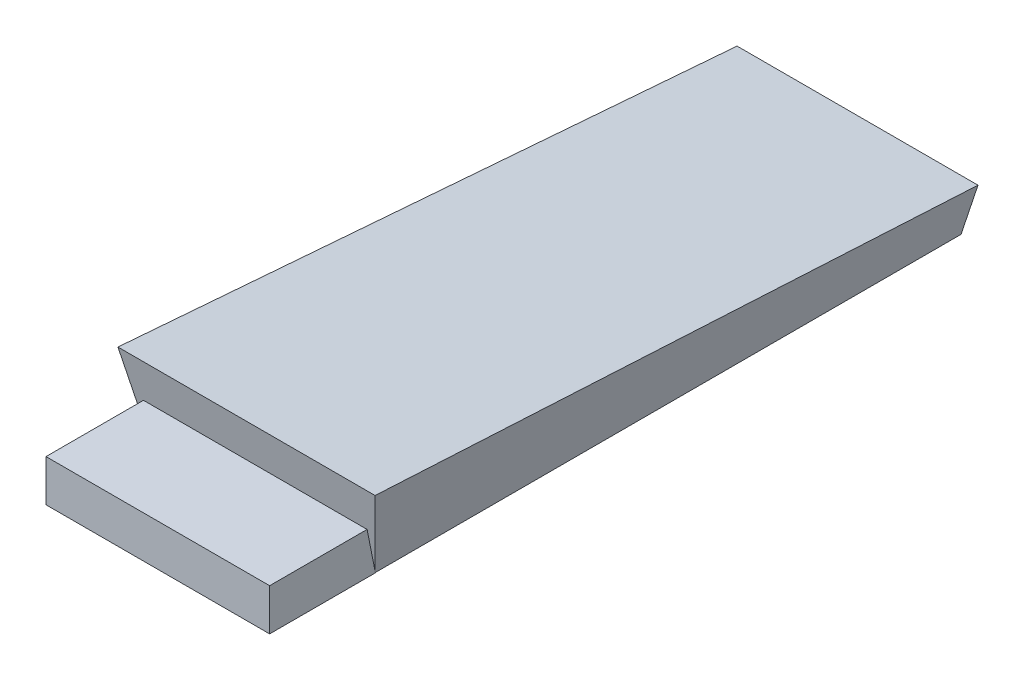
ISO-10303-21;
HEADER;
FILE_DESCRIPTION(('STEP AP214'),'2;1');
FILE_NAME('part.step','',(''),(''),'','','');
FILE_SCHEMA(('AUTOMOTIVE_DESIGN { 1 0 10303 214 1 1 1 1 }'));
ENDSEC;
DATA;
#1=APPLICATION_CONTEXT('core data for automotive mechanical design processes');
#2=APPLICATION_PROTOCOL_DEFINITION('international standard','automotive_design',2000,#1);
#3=PRODUCT_CONTEXT('',#1,'mechanical');
#4=PRODUCT('Part','Part','',(#3));
#5=PRODUCT_RELATED_PRODUCT_CATEGORY('part','',(#4));
#6=PRODUCT_DEFINITION_FORMATION('','',#4);
#7=PRODUCT_DEFINITION_CONTEXT('part definition',#1,'design');
#8=PRODUCT_DEFINITION('design','',#6,#7);
#9=PRODUCT_DEFINITION_SHAPE('','',#8);
#10=(LENGTH_UNIT() NAMED_UNIT(*) SI_UNIT(.MILLI.,.METRE.));
#11=(NAMED_UNIT(*) PLANE_ANGLE_UNIT() SI_UNIT($,.RADIAN.));
#12=(NAMED_UNIT(*) SI_UNIT($,.STERADIAN.) SOLID_ANGLE_UNIT());
#13=UNCERTAINTY_MEASURE_WITH_UNIT(LENGTH_MEASURE(1.E-05),#10,'distance_accuracy_value','');
#14=(GEOMETRIC_REPRESENTATION_CONTEXT(3) GLOBAL_UNCERTAINTY_ASSIGNED_CONTEXT((#13)) GLOBAL_UNIT_ASSIGNED_CONTEXT((#10,
#11,#12)) REPRESENTATION_CONTEXT('',''));
#15=CARTESIAN_POINT('',(0.,0.,0.));
#16=DIRECTION('',(0.,0.,1.));
#17=DIRECTION('',(1.,0.,0.));
#18=AXIS2_PLACEMENT_3D('',#15,#16,#17);
#19=CARTESIAN_POINT('',(-81.6523560214512,469.940527044925,-134.048167539267));
#20=DIRECTION('',(0.980785280403652,-0.195090322014007,0.));
#21=DIRECTION('',(0.195090322014007,0.980785280403652,0.));
#22=AXIS2_PLACEMENT_3D('',#19,#20,#21);
#23=PLANE('',#22);
#24=DIRECTION('',(0.0132624296527402,0.0666747363555162,0.997686617877392));
#25=VECTOR('',#24,1.);
#26=CARTESIAN_POINT('',(-128.711999333493,233.355723734268,-117.611789320366));
#27=LINE('',#26,#25);
#28=CARTESIAN_POINT('',(-124.605597468657,254.000000000129,191.29859101306));
#29=VERTEX_POINT('',#28);
#30=CARTESIAN_POINT('',(-128.310259107283,235.375408239093,-87.3902644529281));
#31=VERTEX_POINT('',#30);
#32=EDGE_CURVE('E80',#29,#31,#27,.F.);
#33=ORIENTED_EDGE('',*,*,#32,.F.);
#34=DIRECTION('',(0.191480453953241,0.962637248140193,0.191480453955323));
#35=VECTOR('',#34,1.);
#36=CARTESIAN_POINT('',(-81.6523560214512,469.940527044925,234.251832460733));
#37=LINE('',#36,#35);
#38=CARTESIAN_POINT('',(-132.037112041846,216.639253299607,183.867076439791));
#39=VERTEX_POINT('',#38);
#40=EDGE_CURVE('E63',#39,#29,#37,.T.);
#41=ORIENTED_EDGE('',*,*,#40,.F.);
#42=CARTESIAN_POINT('',(-132.176097335335,215.940527044815,183.7280911463));
#43=VERTEX_POINT('',#42);
#44=EDGE_CURVE('E107',#43,#39,#37,.T.);
#45=ORIENTED_EDGE('',*,*,#44,.F.);
#46=DIRECTION('',(0.,0.,-1.));
#47=VECTOR('',#46,1.);
#48=CARTESIAN_POINT('',(-132.176097335335,215.940527044815,-134.048167539267));
#49=LINE('',#48,#47);
#50=CARTESIAN_POINT('',(-132.176097335335,215.940527044815,-83.5244262248337));
#51=VERTEX_POINT('',#50);
#52=EDGE_CURVE('E151',#51,#43,#49,.F.);
#53=ORIENTED_EDGE('',*,*,#52,.F.);
#54=DIRECTION('',(0.191480453953241,0.962637248140193,-0.191480453955323));
#55=VECTOR('',#54,1.);
#56=CARTESIAN_POINT('',(-81.6523560214512,469.940527044925,-134.048167539267));
#57=LINE('',#56,#55);
#58=EDGE_CURVE('E160',#51,#31,#57,.T.);
#59=ORIENTED_EDGE('',*,*,#58,.T.);
#60=EDGE_LOOP('',(#33,#41,#45,#53,#59));
#61=FACE_BOUND('',#60,.T.);
#62=ADVANCED_FACE('F38',(#61),#23,.T.);
#63=CARTESIAN_POINT('',(-81.6523560214512,469.940527044925,234.251832460733));
#64=DIRECTION('',(4.21959855350924E-13,-0.195090322016129,0.98078528040323));
#65=DIRECTION('',(-2.12133544489741E-12,0.98078528040323,0.195090322016129));
#66=AXIS2_PLACEMENT_3D('',#63,#64,#65);
#67=PLANE('',#66);
#68=DIRECTION('',(1.,2.16289486321131E-12,0.));
#69=VECTOR('',#68,1.);
#70=CARTESIAN_POINT('',(-234.037112041885,234.990527044595,187.517371744882));
#71=LINE('',#70,#69);
#72=CARTESIAN_POINT('',(-234.037112041885,234.990527044595,187.517371744882));
#73=VERTEX_POINT('',#72);
#74=CARTESIAN_POINT('',(-132.037112041885,234.990527044816,187.517371744882));
#75=VERTEX_POINT('',#74);
#76=EDGE_CURVE('E193',#73,#75,#71,.T.);
#77=ORIENTED_EDGE('',*,*,#76,.T.);
#78=DIRECTION('',(2.12133544489741E-12,-0.98078528040323,-0.195090322016129));
#79=VECTOR('',#78,1.);
#80=CARTESIAN_POINT('',(-132.037112041885,234.990527044816,187.517371744882));
#81=LINE('',#80,#79);
#82=EDGE_CURVE('E55',#75,#39,#81,.T.);
#83=ORIENTED_EDGE('',*,*,#82,.T.);
#84=ORIENTED_EDGE('',*,*,#40,.T.);
#85=DIRECTION('',(-1.,-2.16289486321131E-12,0.));
#86=VECTOR('',#85,1.);
#87=CARTESIAN_POINT('',(-81.6523560209841,254.000000000222,191.29859101306));
#88=LINE('',#87,#86);
#89=CARTESIAN_POINT('',(-241.899114573311,253.999999999875,191.29859101306));
#90=VERTEX_POINT('',#89);
#91=EDGE_CURVE('E11',#90,#29,#88,.F.);
#92=ORIENTED_EDGE('',*,*,#91,.F.);
#93=DIRECTION('',(-0.191480453957405,0.962637248139365,0.191480453955323));
#94=VECTOR('',#93,1.);
#95=CARTESIAN_POINT('',(-271.348723349158,402.05318122467,220.748199788586));
#96=LINE('',#95,#94);
#97=CARTESIAN_POINT('',(-234.328614706469,215.940527044595,183.7280911463));
#98=VERTEX_POINT('',#97);
#99=EDGE_CURVE('E149',#98,#90,#96,.T.);
#100=ORIENTED_EDGE('',*,*,#99,.F.);
#101=DIRECTION('',(1.,2.16289486321131E-12,0.));
#102=VECTOR('',#101,1.);
#103=CARTESIAN_POINT('',(-81.6523560209018,215.940527044925,183.7280911463));
#104=LINE('',#103,#102);
#105=CARTESIAN_POINT('',(-234.037112041844,215.940527044595,183.7280911463));
#106=VERTEX_POINT('',#105);
#107=EDGE_CURVE('E95',#106,#98,#104,.F.);
#108=ORIENTED_EDGE('',*,*,#107,.F.);
#109=DIRECTION('',(2.12133544489741E-12,-0.98078528040323,-0.195090322016129));
#110=VECTOR('',#109,1.);
#111=CARTESIAN_POINT('',(-234.037112041885,234.990527044595,187.517371744882));
#112=LINE('',#111,#110);
#113=EDGE_CURVE('E136',#73,#106,#112,.T.);
#114=ORIENTED_EDGE('',*,*,#113,.F.);
#115=EDGE_LOOP('',(#77,#83,#84,#92,#100,#108,#114));
#116=FACE_BOUND('',#115,.T.);
#117=ADVANCED_FACE('F147',(#116),#67,.T.);
#118=CARTESIAN_POINT('',(-284.852356021451,469.940527044485,-134.048167539267));
#119=DIRECTION('',(-0.980785280402808,-0.19509032201825,0.));
#120=DIRECTION('',(0.19509032201825,-0.980785280402808,0.));
#121=AXIS2_PLACEMENT_3D('',#118,#119,#120);
#122=PLANE('',#121);
#123=DIRECTION('',(0.0132624296530289,-0.0666747363554589,-0.997686617877392));
#124=VECTOR('',#123,1.);
#125=CARTESIAN_POINT('',(-237.792712708386,233.355723734032,-117.611789320366));
#126=LINE('',#125,#124);
#127=CARTESIAN_POINT('',(-238.194452934605,235.375408238855,-87.3902644529281));
#128=VERTEX_POINT('',#127);
#129=EDGE_CURVE('E47',#128,#90,#126,.F.);
#130=ORIENTED_EDGE('',*,*,#129,.F.);
#131=DIRECTION('',(-0.191480453957405,0.962637248139365,-0.191480453955323));
#132=VECTOR('',#131,1.);
#133=CARTESIAN_POINT('',(-277.402075926393,432.485439695622,-126.597887444289));
#134=LINE('',#133,#132);
#135=CARTESIAN_POINT('',(-234.328614706469,215.940527044595,-83.5244262248337));
#136=VERTEX_POINT('',#135);
#137=EDGE_CURVE('E41',#136,#128,#134,.T.);
#138=ORIENTED_EDGE('',*,*,#137,.F.);
#139=DIRECTION('',(0.,0.,1.));
#140=VECTOR('',#139,1.);
#141=CARTESIAN_POINT('',(-234.328614706469,215.940527044595,-134.048167539267));
#142=LINE('',#141,#140);
#143=EDGE_CURVE('E91',#98,#136,#142,.F.);
#144=ORIENTED_EDGE('',*,*,#143,.F.);
#145=ORIENTED_EDGE('',*,*,#99,.T.);
#146=EDGE_LOOP('',(#130,#138,#144,#145));
#147=FACE_BOUND('',#146,.T.);
#148=ADVANCED_FACE('F177',(#147),#122,.T.);
#149=CARTESIAN_POINT('',(-81.6523560214512,469.940527044925,-134.048167539267));
#150=DIRECTION('',(4.21959855350924E-13,-0.195090322016129,-0.98078528040323));
#151=DIRECTION('',(2.12133544489741E-12,-0.98078528040323,0.195090322016129));
#152=AXIS2_PLACEMENT_3D('',#149,#150,#151);
#153=PLANE('',#152);
#154=DIRECTION('',(1.,2.16289486321131E-12,0.));
#155=VECTOR('',#154,1.);
#156=CARTESIAN_POINT('',(-81.6523560209438,235.375408239193,-87.3902644529281));
#157=LINE('',#156,#155);
#158=EDGE_CURVE('E75',#31,#128,#157,.F.);
#159=ORIENTED_EDGE('',*,*,#158,.F.);
#160=ORIENTED_EDGE('',*,*,#58,.F.);
#161=DIRECTION('',(-1.,-2.16289486321131E-12,0.));
#162=VECTOR('',#161,1.);
#163=CARTESIAN_POINT('',(-81.6523560209018,215.940527044925,-83.5244262248337));
#164=LINE('',#163,#162);
#165=EDGE_CURVE('E155',#136,#51,#164,.F.);
#166=ORIENTED_EDGE('',*,*,#165,.F.);
#167=ORIENTED_EDGE('',*,*,#137,.T.);
#168=EDGE_LOOP('',(#159,#160,#166,#167));
#169=FACE_BOUND('',#168,.T.);
#170=ADVANCED_FACE('F175',(#169),#153,.T.);
#171=CARTESIAN_POINT('',(-366.504712041844,215.940527044309,0.));
#172=DIRECTION('',(2.16289486321131E-12,-1.,0.));
#173=DIRECTION('',(0.,0.,1.));
#174=AXIS2_PLACEMENT_3D('',#171,#172,#173);
#175=PLANE('',#174);
#176=ORIENTED_EDGE('',*,*,#52,.T.);
#177=DIRECTION('',(1.,2.16289486321131E-12,0.));
#178=VECTOR('',#177,1.);
#179=CARTESIAN_POINT('',(-234.037112041844,215.940527044595,183.7280911463));
#180=LINE('',#179,#178);
#181=CARTESIAN_POINT('',(-132.037112041844,215.940527044816,183.7280911463));
#182=VERTEX_POINT('',#181);
#183=EDGE_CURVE('E103',#43,#182,#180,.T.);
#184=ORIENTED_EDGE('',*,*,#183,.T.);
#185=DIRECTION('',(0.,0.,1.));
#186=VECTOR('',#185,1.);
#187=CARTESIAN_POINT('',(-132.037112041844,215.940527044816,183.7280911463));
#188=LINE('',#187,#186);
#189=CARTESIAN_POINT('',(-132.037112041844,215.940527044816,231.967371744882));
#190=VERTEX_POINT('',#189);
#191=EDGE_CURVE('E201',#182,#190,#188,.T.);
#192=ORIENTED_EDGE('',*,*,#191,.T.);
#193=DIRECTION('',(1.,2.16289486321131E-12,0.));
#194=VECTOR('',#193,1.);
#195=CARTESIAN_POINT('',(-234.037112041844,215.940527044595,231.967371744882));
#196=LINE('',#195,#194);
#197=CARTESIAN_POINT('',(-234.037112041844,215.940527044595,231.967371744882));
#198=VERTEX_POINT('',#197);
#199=EDGE_CURVE('E131',#198,#190,#196,.T.);
#200=ORIENTED_EDGE('',*,*,#199,.F.);
#201=DIRECTION('',(0.,0.,1.));
#202=VECTOR('',#201,1.);
#203=CARTESIAN_POINT('',(-234.037112041844,215.940527044595,183.7280911463));
#204=LINE('',#203,#202);
#205=EDGE_CURVE('E127',#106,#198,#204,.T.);
#206=ORIENTED_EDGE('',*,*,#205,.F.);
#207=ORIENTED_EDGE('',*,*,#107,.T.);
#208=ORIENTED_EDGE('',*,*,#143,.T.);
#209=ORIENTED_EDGE('',*,*,#165,.T.);
#210=EDGE_LOOP('',(#176,#184,#192,#200,#206,#207,#208,#209));
#211=FACE_BOUND('',#210,.T.);
#212=ADVANCED_FACE('F129',(#211),#175,.T.);
#213=CARTESIAN_POINT('',(-29.787112041901,242.232621811317,15.2175685986643));
#214=DIRECTION('',(-2.15808106388898E-12,0.997774372021401,-0.0666806009068518));
#215=DIRECTION('',(1.44223129177273E-13,-0.0666806009068518,-0.997774372021401));
#216=AXIS2_PLACEMENT_3D('',#213,#214,#215);
#217=PLANE('',#216);
#218=ORIENTED_EDGE('',*,*,#32,.T.);
#219=ORIENTED_EDGE('',*,*,#158,.T.);
#220=ORIENTED_EDGE('',*,*,#129,.T.);
#221=ORIENTED_EDGE('',*,*,#91,.T.);
#222=EDGE_LOOP('',(#218,#219,#220,#221));
#223=FACE_BOUND('',#222,.T.);
#224=ADVANCED_FACE('F178',(#223),#217,.T.);
#225=CARTESIAN_POINT('',(-234.037112041885,234.990527044595,187.517371744882));
#226=DIRECTION('',(4.21959855350925E-13,-0.195090322016129,0.98078528040323));
#227=DIRECTION('',(-2.12133544489741E-12,0.98078528040323,0.195090322016129));
#228=AXIS2_PLACEMENT_3D('',#225,#226,#227);
#229=PLANE('',#228);
#230=ORIENTED_EDGE('',*,*,#183,.F.);
#231=ORIENTED_EDGE('',*,*,#44,.T.);
#232=EDGE_CURVE('E206',#39,#182,#81,.T.);
#233=ORIENTED_EDGE('',*,*,#232,.T.);
#234=EDGE_LOOP('',(#230,#231,#233));
#235=FACE_BOUND('',#234,.T.);
#236=ADVANCED_FACE('F219',(#235),#229,.F.);
#237=CARTESIAN_POINT('',(-234.037112041844,215.940527044595,231.967371744882));
#238=DIRECTION('',(0.,0.,-1.));
#239=DIRECTION('',(1.,2.16289486321131E-12,0.));
#240=AXIS2_PLACEMENT_3D('',#237,#238,#239);
#241=PLANE('',#240);
#242=DIRECTION('',(-2.16289486321131E-12,1.,0.));
#243=VECTOR('',#242,1.);
#244=CARTESIAN_POINT('',(-132.037112041844,215.940527044816,231.967371744882));
#245=LINE('',#244,#243);
#246=CARTESIAN_POINT('',(-132.037112041885,234.990527044816,231.967371744882));
#247=VERTEX_POINT('',#246);
#248=EDGE_CURVE('E198',#190,#247,#245,.T.);
#249=ORIENTED_EDGE('',*,*,#248,.T.);
#250=DIRECTION('',(1.,2.16289486321131E-12,0.));
#251=VECTOR('',#250,1.);
#252=CARTESIAN_POINT('',(-234.037112041885,234.990527044595,231.967371744882));
#253=LINE('',#252,#251);
#254=CARTESIAN_POINT('',(-234.037112041885,234.990527044595,231.967371744882));
#255=VERTEX_POINT('',#254);
#256=EDGE_CURVE('E189',#255,#247,#253,.T.);
#257=ORIENTED_EDGE('',*,*,#256,.F.);
#258=DIRECTION('',(-2.16289486321131E-12,1.,0.));
#259=VECTOR('',#258,1.);
#260=CARTESIAN_POINT('',(-234.037112041844,215.940527044595,231.967371744882));
#261=LINE('',#260,#259);
#262=EDGE_CURVE('E135',#198,#255,#261,.T.);
#263=ORIENTED_EDGE('',*,*,#262,.F.);
#264=ORIENTED_EDGE('',*,*,#199,.T.);
#265=EDGE_LOOP('',(#249,#257,#263,#264));
#266=FACE_BOUND('',#265,.T.);
#267=ADVANCED_FACE('F212',(#266),#241,.F.);
#268=CARTESIAN_POINT('',(-234.037112041885,234.990527044595,231.967371744882));
#269=DIRECTION('',(2.16289486321131E-12,-1.,0.));
#270=DIRECTION('',(0.,0.,1.));
#271=AXIS2_PLACEMENT_3D('',#268,#269,#270);
#272=PLANE('',#271);
#273=DIRECTION('',(0.,0.,-1.));
#274=VECTOR('',#273,1.);
#275=CARTESIAN_POINT('',(-132.037112041885,234.990527044816,231.967371744882));
#276=LINE('',#275,#274);
#277=EDGE_CURVE('E145',#247,#75,#276,.T.);
#278=ORIENTED_EDGE('',*,*,#277,.T.);
#279=ORIENTED_EDGE('',*,*,#76,.F.);
#280=DIRECTION('',(0.,0.,-1.));
#281=VECTOR('',#280,1.);
#282=CARTESIAN_POINT('',(-234.037112041885,234.990527044595,231.967371744882));
#283=LINE('',#282,#281);
#284=EDGE_CURVE('E141',#255,#73,#283,.T.);
#285=ORIENTED_EDGE('',*,*,#284,.F.);
#286=ORIENTED_EDGE('',*,*,#256,.T.);
#287=EDGE_LOOP('',(#278,#279,#285,#286));
#288=FACE_BOUND('',#287,.T.);
#289=ADVANCED_FACE('F215',(#288),#272,.F.);
#290=CARTESIAN_POINT('',(-234.037112042394,469.940527044595,0.));
#291=DIRECTION('',(-1.,-2.16289486321131E-12,0.));
#292=DIRECTION('',(0.,0.,-1.));
#293=AXIS2_PLACEMENT_3D('',#290,#291,#292);
#294=PLANE('',#293);
#295=ORIENTED_EDGE('',*,*,#113,.T.);
#296=ORIENTED_EDGE('',*,*,#205,.T.);
#297=ORIENTED_EDGE('',*,*,#262,.T.);
#298=ORIENTED_EDGE('',*,*,#284,.T.);
#299=EDGE_LOOP('',(#295,#296,#297,#298));
#300=FACE_BOUND('',#299,.T.);
#301=ADVANCED_FACE('F139',(#300),#294,.T.);
#302=CARTESIAN_POINT('',(-132.037112042394,469.940527044816,0.));
#303=DIRECTION('',(-1.,-2.16289486321131E-12,0.));
#304=DIRECTION('',(0.,0.,-1.));
#305=AXIS2_PLACEMENT_3D('',#302,#303,#304);
#306=PLANE('',#305);
#307=ORIENTED_EDGE('',*,*,#82,.F.);
#308=ORIENTED_EDGE('',*,*,#277,.F.);
#309=ORIENTED_EDGE('',*,*,#248,.F.);
#310=ORIENTED_EDGE('',*,*,#191,.F.);
#311=ORIENTED_EDGE('',*,*,#232,.F.);
#312=EDGE_LOOP('',(#307,#308,#309,#310,#311));
#313=FACE_BOUND('',#312,.T.);
#314=ADVANCED_FACE('F216',(#313),#306,.F.);
#315=CLOSED_SHELL('',(#62,#117,#148,#170,#212,#224,#236,#267,#289,#301,#314));
#316=MANIFOLD_SOLID_BREP('B2',#315);
#317=ADVANCED_BREP_SHAPE_REPRESENTATION('',(#18,#316),#14);
#318=SHAPE_DEFINITION_REPRESENTATION(#9,#317);
ENDSEC;
END-ISO-10303-21;
